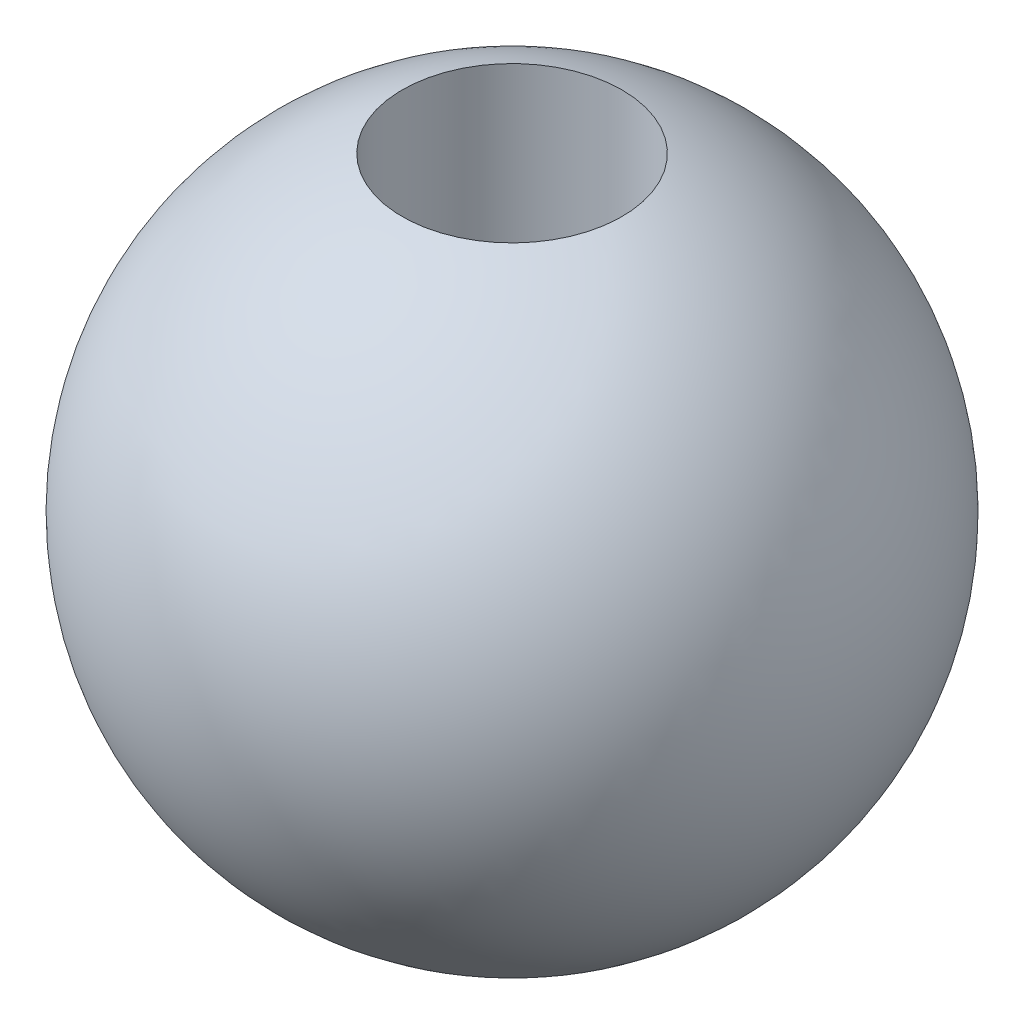
ISO-10303-21;
HEADER;
FILE_DESCRIPTION(('STEP AP214'),'2;1');
FILE_NAME('part.step','',(''),(''),'','','');
FILE_SCHEMA(('AUTOMOTIVE_DESIGN { 1 0 10303 214 1 1 1 1 }'));
ENDSEC;
DATA;
#1=APPLICATION_CONTEXT('core data for automotive mechanical design processes');
#2=APPLICATION_PROTOCOL_DEFINITION('international standard','automotive_design',2000,#1);
#3=PRODUCT_CONTEXT('',#1,'mechanical');
#4=PRODUCT('Part','Part','',(#3));
#5=PRODUCT_RELATED_PRODUCT_CATEGORY('part','',(#4));
#6=PRODUCT_DEFINITION_FORMATION('','',#4);
#7=PRODUCT_DEFINITION_CONTEXT('part definition',#1,'design');
#8=PRODUCT_DEFINITION('design','',#6,#7);
#9=PRODUCT_DEFINITION_SHAPE('','',#8);
#10=(LENGTH_UNIT() NAMED_UNIT(*) SI_UNIT(.MILLI.,.METRE.));
#11=(NAMED_UNIT(*) PLANE_ANGLE_UNIT() SI_UNIT($,.RADIAN.));
#12=(NAMED_UNIT(*) SI_UNIT($,.STERADIAN.) SOLID_ANGLE_UNIT());
#13=UNCERTAINTY_MEASURE_WITH_UNIT(LENGTH_MEASURE(1.E-05),#10,'distance_accuracy_value','');
#14=(GEOMETRIC_REPRESENTATION_CONTEXT(3) GLOBAL_UNCERTAINTY_ASSIGNED_CONTEXT((#13)) GLOBAL_UNIT_ASSIGNED_CONTEXT((#10,
#11,#12)) REPRESENTATION_CONTEXT('',''));
#15=CARTESIAN_POINT('',(0.,0.,0.));
#16=DIRECTION('',(0.,0.,1.));
#17=DIRECTION('',(1.,0.,0.));
#18=AXIS2_PLACEMENT_3D('',#15,#16,#17);
#19=CARTESIAN_POINT('',(0.,0.,0.));
#20=DIRECTION('',(0.,-1.,0.));
#21=DIRECTION('',(1.,0.,0.));
#22=AXIS2_PLACEMENT_3D('',#19,#20,#21);
#23=SPHERICAL_SURFACE('',#22,1.5);
#24=CARTESIAN_POINT('',(0.,1.41421356237309,0.));
#25=DIRECTION('',(0.,-1.,0.));
#26=DIRECTION('',(0.,0.,-1.));
#27=AXIS2_PLACEMENT_3D('',#24,#25,#26);
#28=CIRCLE('',#27,0.5);
#29=CARTESIAN_POINT('',(0.,1.41421356237309,-0.5));
#30=VERTEX_POINT('',#29);
#31=EDGE_CURVE('E10',#30,#30,#28,.T.);
#32=ORIENTED_EDGE('',*,*,#31,.T.);
#33=EDGE_LOOP('',(#32));
#34=FACE_BOUND('',#33,.T.);
#35=CARTESIAN_POINT('',(0.,-1.41421356237309,0.));
#36=DIRECTION('',(0.,-1.,0.));
#37=DIRECTION('',(0.,0.,-1.));
#38=AXIS2_PLACEMENT_3D('',#35,#36,#37);
#39=CIRCLE('',#38,0.5);
#40=CARTESIAN_POINT('',(0.,-1.41421356237309,-0.5));
#41=VERTEX_POINT('',#40);
#42=EDGE_CURVE('E44',#41,#41,#39,.T.);
#43=ORIENTED_EDGE('',*,*,#42,.F.);
#44=EDGE_LOOP('',(#43));
#45=FACE_BOUND('',#44,.T.);
#46=ADVANCED_FACE('F37',(#34,#45),#23,.T.);
#47=CARTESIAN_POINT('',(0.,-1.5,0.));
#48=DIRECTION('',(0.,-1.,0.));
#49=DIRECTION('',(0.,0.,-1.));
#50=AXIS2_PLACEMENT_3D('',#47,#48,#49);
#51=CYLINDRICAL_SURFACE('',#50,0.5);
#52=ORIENTED_EDGE('',*,*,#42,.T.);
#53=EDGE_LOOP('',(#52));
#54=FACE_BOUND('',#53,.T.);
#55=ORIENTED_EDGE('',*,*,#31,.F.);
#56=EDGE_LOOP('',(#55));
#57=FACE_BOUND('',#56,.T.);
#58=ADVANCED_FACE('F51',(#54,#57),#51,.F.);
#59=CLOSED_SHELL('',(#46,#58));
#60=MANIFOLD_SOLID_BREP('B2',#59);
#61=ADVANCED_BREP_SHAPE_REPRESENTATION('',(#18,#60),#14);
#62=SHAPE_DEFINITION_REPRESENTATION(#9,#61);
ENDSEC;
END-ISO-10303-21;
